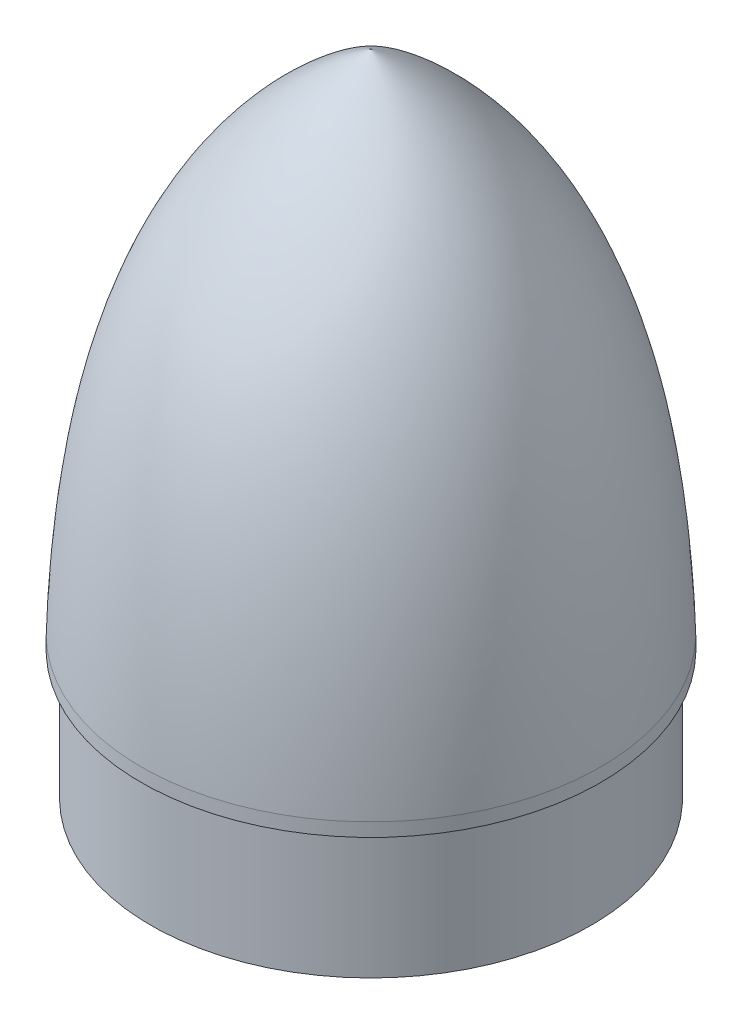
ISO-10303-21;
HEADER;
FILE_DESCRIPTION(('STEP AP214'),'2;1');
FILE_NAME('part.step','',(''),(''),'','','');
FILE_SCHEMA(('AUTOMOTIVE_DESIGN { 1 0 10303 214 1 1 1 1 }'));
ENDSEC;
DATA;
#1=APPLICATION_CONTEXT('core data for automotive mechanical design processes');
#2=APPLICATION_PROTOCOL_DEFINITION('international standard','automotive_design',2000,#1);
#3=PRODUCT_CONTEXT('',#1,'mechanical');
#4=PRODUCT('Part','Part','',(#3));
#5=PRODUCT_RELATED_PRODUCT_CATEGORY('part','',(#4));
#6=PRODUCT_DEFINITION_FORMATION('','',#4);
#7=PRODUCT_DEFINITION_CONTEXT('part definition',#1,'design');
#8=PRODUCT_DEFINITION('design','',#6,#7);
#9=PRODUCT_DEFINITION_SHAPE('','',#8);
#10=(LENGTH_UNIT() NAMED_UNIT(*) SI_UNIT(.MILLI.,.METRE.));
#11=(NAMED_UNIT(*) PLANE_ANGLE_UNIT() SI_UNIT($,.RADIAN.));
#12=(NAMED_UNIT(*) SI_UNIT($,.STERADIAN.) SOLID_ANGLE_UNIT());
#13=UNCERTAINTY_MEASURE_WITH_UNIT(LENGTH_MEASURE(1.E-05),#10,'distance_accuracy_value','');
#14=(GEOMETRIC_REPRESENTATION_CONTEXT(3) GLOBAL_UNCERTAINTY_ASSIGNED_CONTEXT((#13)) GLOBAL_UNIT_ASSIGNED_CONTEXT((#10,
#11,#12)) REPRESENTATION_CONTEXT('',''));
#15=CARTESIAN_POINT('',(0.,0.,0.));
#16=DIRECTION('',(0.,0.,1.));
#17=DIRECTION('',(1.,0.,0.));
#18=AXIS2_PLACEMENT_3D('',#15,#16,#17);
#19=CARTESIAN_POINT('',(-13.3323668665777,13.1774193548387,0.));
#20=DIRECTION('',(0.,1.,0.));
#21=DIRECTION('',(0.,0.,1.));
#22=AXIS2_PLACEMENT_3D('',#19,#20,#21);
#23=PLANE('',#22);
#24=CARTESIAN_POINT('',(19.2676331334223,13.1774193548387,0.));
#25=DIRECTION('',(0.,-1.,0.));
#26=DIRECTION('',(0.,0.,-1.));
#27=AXIS2_PLACEMENT_3D('',#24,#25,#26);
#28=CIRCLE('',#27,32.6);
#29=CARTESIAN_POINT('',(19.2676331334223,13.1774193548387,-32.6));
#30=VERTEX_POINT('',#29);
#31=EDGE_CURVE('E80',#30,#30,#28,.T.);
#32=ORIENTED_EDGE('',*,*,#31,.F.);
#33=EDGE_LOOP('',(#32));
#34=FACE_BOUND('',#33,.T.);
#35=CARTESIAN_POINT('',(19.2676331334223,13.1774193548387,0.));
#36=DIRECTION('',(0.,-1.,0.));
#37=DIRECTION('',(0.,0.,-1.));
#38=AXIS2_PLACEMENT_3D('',#35,#36,#37);
#39=CIRCLE('',#38,34.);
#40=CARTESIAN_POINT('',(19.2676331334223,13.1774193548387,-34.));
#41=VERTEX_POINT('',#40);
#42=EDGE_CURVE('E11',#41,#41,#39,.T.);
#43=ORIENTED_EDGE('',*,*,#42,.T.);
#44=EDGE_LOOP('',(#43));
#45=FACE_BOUND('',#44,.T.);
#46=ADVANCED_FACE('F36',(#34,#45),#23,.F.);
#47=CARTESIAN_POINT('',(19.2676331334223,86.9881760557627,0.));
#48=DIRECTION('',(0.,-1.,0.));
#49=DIRECTION('',(0.,0.,-1.));
#50=AXIS2_PLACEMENT_3D('',#47,#48,#49);
#51=CYLINDRICAL_SURFACE('',#50,34.);
#52=ORIENTED_EDGE('',*,*,#42,.F.);
#53=EDGE_LOOP('',(#52));
#54=FACE_BOUND('',#53,.T.);
#55=CARTESIAN_POINT('',(19.2676331334223,15.1774193548387,0.));
#56=DIRECTION('',(0.,-1.,0.));
#57=DIRECTION('',(0.,0.,-1.));
#58=AXIS2_PLACEMENT_3D('',#55,#56,#57);
#59=CIRCLE('',#58,34.);
#60=CARTESIAN_POINT('',(19.2676331334223,15.1774193548387,-34.));
#61=VERTEX_POINT('',#60);
#62=EDGE_CURVE('E43',#61,#61,#59,.T.);
#63=ORIENTED_EDGE('',*,*,#62,.T.);
#64=EDGE_LOOP('',(#63));
#65=FACE_BOUND('',#64,.T.);
#66=ADVANCED_FACE('F91',(#54,#65),#51,.T.);
#67=CARTESIAN_POINT('',(19.2676331334223,90.1774193548387,0.));
#68=CARTESIAN_POINT('',(-8.31071189177908,74.8433380490171,0.));
#69=CARTESIAN_POINT('',(-13.7616003208155,43.1643183338417,0.));
#70=CARTESIAN_POINT('',(-14.7323668665777,15.1774193548387,0.));
#71=B_SPLINE_CURVE_WITH_KNOTS('',3,(#67,#68,#69,#70),.UNSPECIFIED.,.F.,.F.,(4,4),(0.,1.),.UNSPECIFIED.);
#72=CARTESIAN_POINT('',(19.2676331334223,86.9881760557627,0.));
#73=DIRECTION('',(0.,-1.,0.));
#74=AXIS1_PLACEMENT('',#72,#73);
#75=SURFACE_OF_REVOLUTION('',#71,#74);
#76=ORIENTED_EDGE('',*,*,#62,.F.);
#77=EDGE_LOOP('',(#76));
#78=FACE_BOUND('',#77,.T.);
#79=CARTESIAN_POINT('',(19.2676331334223,90.1774193548387,0.));
#80=VERTEX_POINT('',#79);
#81=VERTEX_LOOP('',#80);
#82=FACE_BOUND('',#81,.T.);
#83=ADVANCED_FACE('F53',(#78,#82),#75,.T.);
#84=CARTESIAN_POINT('',(19.2676331334223,79.7255117470976,0.));
#85=DIRECTION('',(0.,-1.,0.));
#86=DIRECTION('',(0.,0.,-1.));
#87=AXIS2_PLACEMENT_3D('',#84,#85,#86);
#88=CONICAL_SURFACE('',#87,8.27645973574851,0.850547311862776);
#89=CARTESIAN_POINT('',(19.2676331334223,86.9881760557627,0.));
#90=VERTEX_POINT('',#89);
#91=VERTEX_LOOP('',#90);
#92=FACE_BOUND('',#91,.T.);
#93=CARTESIAN_POINT('',(19.2676331334223,79.7255117470976,0.));
#94=DIRECTION('',(0.,-1.,0.));
#95=DIRECTION('',(0.,0.,-1.));
#96=AXIS2_PLACEMENT_3D('',#93,#94,#95);
#97=CIRCLE('',#96,8.27645973574851);
#98=CARTESIAN_POINT('',(19.2676331334223,79.7255117470976,-8.27645973574851));
#99=VERTEX_POINT('',#98);
#100=EDGE_CURVE('E57',#99,#99,#97,.T.);
#101=ORIENTED_EDGE('',*,*,#100,.T.);
#102=EDGE_LOOP('',(#101));
#103=FACE_BOUND('',#102,.T.);
#104=ADVANCED_FACE('F49',(#92,#103),#88,.F.);
#105=CARTESIAN_POINT('',(19.2676331334223,63.5634977230571,0.));
#106=DIRECTION('',(0.,-1.,0.));
#107=DIRECTION('',(0.,0.,-1.));
#108=AXIS2_PLACEMENT_3D('',#105,#106,#107);
#109=CONICAL_SURFACE('',#108,21.28363127874,0.677660274863654);
#110=ORIENTED_EDGE('',*,*,#100,.F.);
#111=EDGE_LOOP('',(#110));
#112=FACE_BOUND('',#111,.T.);
#113=CARTESIAN_POINT('',(19.2676331334223,63.5634977230571,0.));
#114=DIRECTION('',(0.,-1.,0.));
#115=DIRECTION('',(0.,0.,-1.));
#116=AXIS2_PLACEMENT_3D('',#113,#114,#115);
#117=CIRCLE('',#116,21.28363127874);
#118=CARTESIAN_POINT('',(19.2676331334223,63.5634977230571,-21.28363127874));
#119=VERTEX_POINT('',#118);
#120=EDGE_CURVE('E59',#119,#119,#117,.T.);
#121=ORIENTED_EDGE('',*,*,#120,.T.);
#122=EDGE_LOOP('',(#121));
#123=FACE_BOUND('',#122,.T.);
#124=ADVANCED_FACE('F52',(#112,#123),#109,.F.);
#125=CARTESIAN_POINT('',(19.2676331334223,48.8155133413121,0.));
#126=DIRECTION('',(0.,-1.,0.));
#127=DIRECTION('',(0.,0.,-1.));
#128=AXIS2_PLACEMENT_3D('',#125,#126,#127);
#129=CONICAL_SURFACE('',#128,26.1417908397854,0.31821700019878);
#130=ORIENTED_EDGE('',*,*,#120,.F.);
#131=EDGE_LOOP('',(#130));
#132=FACE_BOUND('',#131,.T.);
#133=CARTESIAN_POINT('',(19.2676331334223,48.8155133413121,0.));
#134=DIRECTION('',(0.,-1.,0.));
#135=DIRECTION('',(0.,0.,-1.));
#136=AXIS2_PLACEMENT_3D('',#133,#134,#135);
#137=CIRCLE('',#136,26.1417908397854);
#138=CARTESIAN_POINT('',(19.2676331334223,48.8155133413121,-26.1417908397854));
#139=VERTEX_POINT('',#138);
#140=EDGE_CURVE('E63',#139,#139,#137,.T.);
#141=ORIENTED_EDGE('',*,*,#140,.T.);
#142=EDGE_LOOP('',(#141));
#143=FACE_BOUND('',#142,.T.);
#144=ADVANCED_FACE('F131',(#132,#143),#129,.F.);
#145=CARTESIAN_POINT('',(19.2676331334223,32.8529890693057,0.));
#146=DIRECTION('',(0.,-1.,0.));
#147=DIRECTION('',(0.,0.,-1.));
#148=AXIS2_PLACEMENT_3D('',#145,#146,#147);
#149=CONICAL_SURFACE('',#148,29.6119048119606,0.214060683563821);
#150=ORIENTED_EDGE('',*,*,#140,.F.);
#151=EDGE_LOOP('',(#150));
#152=FACE_BOUND('',#151,.T.);
#153=CARTESIAN_POINT('',(19.2676331334223,32.8529890693057,0.));
#154=DIRECTION('',(0.,-1.,0.));
#155=DIRECTION('',(0.,0.,-1.));
#156=AXIS2_PLACEMENT_3D('',#153,#154,#155);
#157=CIRCLE('',#156,29.6119048119606);
#158=CARTESIAN_POINT('',(19.2676331334223,32.8529890693057,-29.6119048119606));
#159=VERTEX_POINT('',#158);
#160=EDGE_CURVE('E68',#159,#159,#157,.T.);
#161=ORIENTED_EDGE('',*,*,#160,.T.);
#162=EDGE_LOOP('',(#161));
#163=FACE_BOUND('',#162,.T.);
#164=ADVANCED_FACE('F127',(#152,#163),#149,.F.);
#165=CARTESIAN_POINT('',(19.2676331334223,15.1774193548387,0.));
#166=DIRECTION('',(0.,-1.,0.));
#167=DIRECTION('',(0.,0.,-1.));
#168=AXIS2_PLACEMENT_3D('',#165,#166,#167);
#169=CONICAL_SURFACE('',#168,31.6,0.112006257268921);
#170=ORIENTED_EDGE('',*,*,#160,.F.);
#171=EDGE_LOOP('',(#170));
#172=FACE_BOUND('',#171,.T.);
#173=CARTESIAN_POINT('',(19.2676331334223,15.1774193548387,0.));
#174=DIRECTION('',(0.,-1.,0.));
#175=DIRECTION('',(0.,0.,-1.));
#176=AXIS2_PLACEMENT_3D('',#173,#174,#175);
#177=CIRCLE('',#176,31.6);
#178=CARTESIAN_POINT('',(19.2676331334223,15.1774193548387,-31.6));
#179=VERTEX_POINT('',#178);
#180=EDGE_CURVE('E71',#179,#179,#177,.T.);
#181=ORIENTED_EDGE('',*,*,#180,.T.);
#182=EDGE_LOOP('',(#181));
#183=FACE_BOUND('',#182,.T.);
#184=ADVANCED_FACE('F123',(#172,#183),#169,.F.);
#185=CARTESIAN_POINT('',(19.2676331334223,86.9881760557627,0.));
#186=DIRECTION('',(0.,-1.,0.));
#187=DIRECTION('',(0.,0.,-1.));
#188=AXIS2_PLACEMENT_3D('',#185,#186,#187);
#189=CYLINDRICAL_SURFACE('',#188,31.6);
#190=ORIENTED_EDGE('',*,*,#180,.F.);
#191=EDGE_LOOP('',(#190));
#192=FACE_BOUND('',#191,.T.);
#193=CARTESIAN_POINT('',(19.2676331334223,-5.82258064516129,0.));
#194=DIRECTION('',(0.,-1.,0.));
#195=DIRECTION('',(0.,0.,-1.));
#196=AXIS2_PLACEMENT_3D('',#193,#194,#195);
#197=CIRCLE('',#196,31.6);
#198=CARTESIAN_POINT('',(19.2676331334223,-5.82258064516129,-31.6));
#199=VERTEX_POINT('',#198);
#200=EDGE_CURVE('E74',#199,#199,#197,.T.);
#201=ORIENTED_EDGE('',*,*,#200,.T.);
#202=EDGE_LOOP('',(#201));
#203=FACE_BOUND('',#202,.T.);
#204=ADVANCED_FACE('F116',(#192,#203),#189,.F.);
#205=CARTESIAN_POINT('',(-13.3323668665777,-5.82258064516129,0.));
#206=DIRECTION('',(0.,1.,0.));
#207=DIRECTION('',(0.,0.,1.));
#208=AXIS2_PLACEMENT_3D('',#205,#206,#207);
#209=PLANE('',#208);
#210=ORIENTED_EDGE('',*,*,#200,.F.);
#211=EDGE_LOOP('',(#210));
#212=FACE_BOUND('',#211,.T.);
#213=CARTESIAN_POINT('',(19.2676331334223,-5.82258064516129,0.));
#214=DIRECTION('',(0.,-1.,0.));
#215=DIRECTION('',(0.,0.,-1.));
#216=AXIS2_PLACEMENT_3D('',#213,#214,#215);
#217=CIRCLE('',#216,32.6);
#218=CARTESIAN_POINT('',(19.2676331334223,-5.82258064516129,-32.6));
#219=VERTEX_POINT('',#218);
#220=EDGE_CURVE('E77',#219,#219,#217,.T.);
#221=ORIENTED_EDGE('',*,*,#220,.T.);
#222=EDGE_LOOP('',(#221));
#223=FACE_BOUND('',#222,.T.);
#224=ADVANCED_FACE('F110',(#212,#223),#209,.F.);
#225=CARTESIAN_POINT('',(19.2676331334223,86.9881760557627,0.));
#226=DIRECTION('',(0.,-1.,0.));
#227=DIRECTION('',(0.,0.,-1.));
#228=AXIS2_PLACEMENT_3D('',#225,#226,#227);
#229=CYLINDRICAL_SURFACE('',#228,32.6);
#230=ORIENTED_EDGE('',*,*,#220,.F.);
#231=EDGE_LOOP('',(#230));
#232=FACE_BOUND('',#231,.T.);
#233=ORIENTED_EDGE('',*,*,#31,.T.);
#234=EDGE_LOOP('',(#233));
#235=FACE_BOUND('',#234,.T.);
#236=ADVANCED_FACE('F108',(#232,#235),#229,.T.);
#237=CLOSED_SHELL('',(#46,#66,#83,#104,#124,#144,#164,#184,#204,#224,#236));
#238=MANIFOLD_SOLID_BREP('B2',#237);
#239=ADVANCED_BREP_SHAPE_REPRESENTATION('',(#18,#238),#14);
#240=SHAPE_DEFINITION_REPRESENTATION(#9,#239);
ENDSEC;
END-ISO-10303-21;
